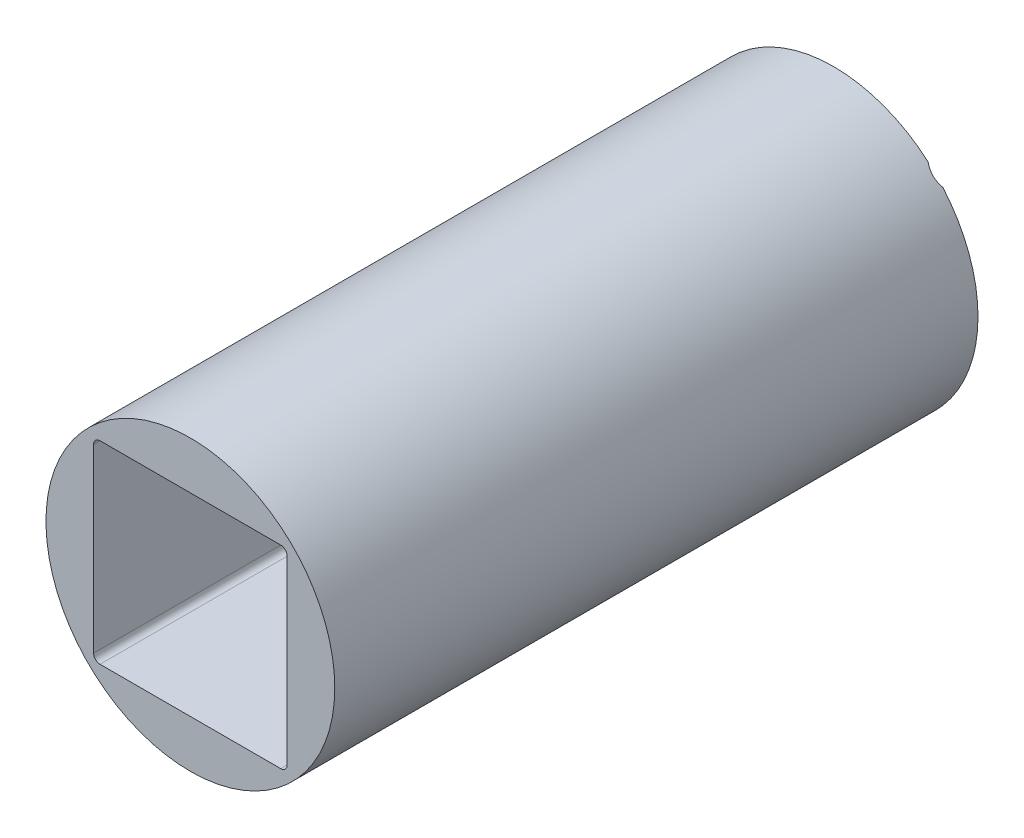
ISO-10303-21;
HEADER;
FILE_DESCRIPTION(('STEP AP214'),'2;1');
FILE_NAME('part.step','',(''),(''),'','','');
FILE_SCHEMA(('AUTOMOTIVE_DESIGN { 1 0 10303 214 1 1 1 1 }'));
ENDSEC;
DATA;
#1=APPLICATION_CONTEXT('core data for automotive mechanical design processes');
#2=APPLICATION_PROTOCOL_DEFINITION('international standard','automotive_design',2000,#1);
#3=PRODUCT_CONTEXT('',#1,'mechanical');
#4=PRODUCT('Part','Part','',(#3));
#5=PRODUCT_RELATED_PRODUCT_CATEGORY('part','',(#4));
#6=PRODUCT_DEFINITION_FORMATION('','',#4);
#7=PRODUCT_DEFINITION_CONTEXT('part definition',#1,'design');
#8=PRODUCT_DEFINITION('design','',#6,#7);
#9=PRODUCT_DEFINITION_SHAPE('','',#8);
#10=(LENGTH_UNIT() NAMED_UNIT(*) SI_UNIT(.MILLI.,.METRE.));
#11=(NAMED_UNIT(*) PLANE_ANGLE_UNIT() SI_UNIT($,.RADIAN.));
#12=(NAMED_UNIT(*) SI_UNIT($,.STERADIAN.) SOLID_ANGLE_UNIT());
#13=UNCERTAINTY_MEASURE_WITH_UNIT(LENGTH_MEASURE(1.E-05),#10,'distance_accuracy_value','');
#14=(GEOMETRIC_REPRESENTATION_CONTEXT(3) GLOBAL_UNCERTAINTY_ASSIGNED_CONTEXT((#13)) GLOBAL_UNIT_ASSIGNED_CONTEXT((#10,
#11,#12)) REPRESENTATION_CONTEXT('',''));
#15=CARTESIAN_POINT('',(0.,0.,0.));
#16=DIRECTION('',(0.,0.,1.));
#17=DIRECTION('',(1.,0.,0.));
#18=AXIS2_PLACEMENT_3D('',#15,#16,#17);
#19=CARTESIAN_POINT('',(0.,0.,0.));
#20=DIRECTION('',(0.,0.,1.));
#21=DIRECTION('',(1.,0.,0.));
#22=AXIS2_PLACEMENT_3D('',#19,#20,#21);
#23=PLANE('',#22);
#24=DIRECTION('',(1.,0.,0.));
#25=VECTOR('',#24,1.);
#26=CARTESIAN_POINT('',(14.05,-17.05,0.));
#27=LINE('',#26,#25);
#28=CARTESIAN_POINT('',(-14.05,-17.05,0.));
#29=VERTEX_POINT('',#28);
#30=CARTESIAN_POINT('',(14.05,-17.05,0.));
#31=VERTEX_POINT('',#30);
#32=EDGE_CURVE('E199',#29,#31,#27,.T.);
#33=ORIENTED_EDGE('',*,*,#32,.T.);
#34=CARTESIAN_POINT('',(14.05,-14.05,0.));
#35=DIRECTION('',(0.,0.,1.));
#36=DIRECTION('',(1.,0.,0.));
#37=AXIS2_PLACEMENT_3D('',#34,#35,#36);
#38=CIRCLE('',#37,3.);
#39=CARTESIAN_POINT('',(14.6833687751314,-16.9823785558295,0.));
#40=VERTEX_POINT('',#39);
#41=EDGE_CURVE('E202',#31,#40,#38,.T.);
#42=ORIENTED_EDGE('',*,*,#41,.T.);
#43=CARTESIAN_POINT('',(0.,0.,0.));
#44=DIRECTION('',(0.,0.,1.));
#45=DIRECTION('',(1.,0.,0.));
#46=AXIS2_PLACEMENT_3D('',#43,#44,#45);
#47=CIRCLE('',#46,22.45);
#48=CARTESIAN_POINT('',(-14.6833687751314,-16.9823785558295,0.));
#49=VERTEX_POINT('',#48);
#50=EDGE_CURVE('E314',#49,#40,#47,.T.);
#51=ORIENTED_EDGE('',*,*,#50,.F.);
#52=CARTESIAN_POINT('',(-14.05,-14.05,0.));
#53=DIRECTION('',(0.,0.,1.));
#54=DIRECTION('',(1.,0.,0.));
#55=AXIS2_PLACEMENT_3D('',#52,#53,#54);
#56=CIRCLE('',#55,3.);
#57=EDGE_CURVE('E197',#49,#29,#56,.T.);
#58=ORIENTED_EDGE('',*,*,#57,.T.);
#59=EDGE_LOOP('',(#33,#42,#51,#58));
#60=FACE_BOUND('',#59,.T.);
#61=ADVANCED_FACE('F35',(#60),#23,.F.);
#62=CARTESIAN_POINT('',(16.9823785558295,-14.6833687751314,0.));
#63=VERTEX_POINT('',#62);
#64=CARTESIAN_POINT('',(16.9823785558295,14.6833687751314,0.));
#65=VERTEX_POINT('',#64);
#66=EDGE_CURVE('E318',#63,#65,#47,.T.);
#67=ORIENTED_EDGE('',*,*,#66,.F.);
#68=CARTESIAN_POINT('',(14.05,-14.05,0.));
#69=DIRECTION('',(0.,0.,1.));
#70=DIRECTION('',(1.,0.,0.));
#71=AXIS2_PLACEMENT_3D('',#68,#69,#70);
#72=CIRCLE('',#71,3.);
#73=CARTESIAN_POINT('',(17.05,-14.05,0.));
#74=VERTEX_POINT('',#73);
#75=EDGE_CURVE('E195',#63,#74,#72,.T.);
#76=ORIENTED_EDGE('',*,*,#75,.T.);
#77=DIRECTION('',(0.,1.,0.));
#78=VECTOR('',#77,1.);
#79=CARTESIAN_POINT('',(17.05,14.05,0.));
#80=LINE('',#79,#78);
#81=CARTESIAN_POINT('',(17.05,14.05,0.));
#82=VERTEX_POINT('',#81);
#83=EDGE_CURVE('E193',#74,#82,#80,.T.);
#84=ORIENTED_EDGE('',*,*,#83,.T.);
#85=CARTESIAN_POINT('',(14.05,14.05,0.));
#86=DIRECTION('',(0.,0.,1.));
#87=DIRECTION('',(1.,0.,0.));
#88=AXIS2_PLACEMENT_3D('',#85,#86,#87);
#89=CIRCLE('',#88,3.);
#90=EDGE_CURVE('E191',#82,#65,#89,.T.);
#91=ORIENTED_EDGE('',*,*,#90,.T.);
#92=EDGE_LOOP('',(#67,#76,#84,#91));
#93=FACE_BOUND('',#92,.T.);
#94=ADVANCED_FACE('F276',(#93),#23,.F.);
#95=DIRECTION('',(0.,-1.,0.));
#96=VECTOR('',#95,1.);
#97=CARTESIAN_POINT('',(-17.05,-14.05,0.));
#98=LINE('',#97,#96);
#99=CARTESIAN_POINT('',(-17.05,14.05,0.));
#100=VERTEX_POINT('',#99);
#101=CARTESIAN_POINT('',(-17.05,-14.05,0.));
#102=VERTEX_POINT('',#101);
#103=EDGE_CURVE('E187',#100,#102,#98,.T.);
#104=ORIENTED_EDGE('',*,*,#103,.T.);
#105=CARTESIAN_POINT('',(-14.05,-14.05,0.));
#106=DIRECTION('',(0.,0.,1.));
#107=DIRECTION('',(1.,0.,0.));
#108=AXIS2_PLACEMENT_3D('',#105,#106,#107);
#109=CIRCLE('',#108,3.);
#110=CARTESIAN_POINT('',(-16.9823785558295,-14.6833687751314,0.));
#111=VERTEX_POINT('',#110);
#112=EDGE_CURVE('E189',#102,#111,#109,.T.);
#113=ORIENTED_EDGE('',*,*,#112,.T.);
#114=CARTESIAN_POINT('',(-16.9823785558295,14.6833687751314,0.));
#115=VERTEX_POINT('',#114);
#116=EDGE_CURVE('E316',#115,#111,#47,.T.);
#117=ORIENTED_EDGE('',*,*,#116,.F.);
#118=CARTESIAN_POINT('',(-14.05,14.05,0.));
#119=DIRECTION('',(0.,0.,1.));
#120=DIRECTION('',(1.,0.,0.));
#121=AXIS2_PLACEMENT_3D('',#118,#119,#120);
#122=CIRCLE('',#121,3.);
#123=EDGE_CURVE('E185',#115,#100,#122,.T.);
#124=ORIENTED_EDGE('',*,*,#123,.T.);
#125=EDGE_LOOP('',(#104,#113,#117,#124));
#126=FACE_BOUND('',#125,.T.);
#127=ADVANCED_FACE('F281',(#126),#23,.F.);
#128=CARTESIAN_POINT('',(0.,0.,100.));
#129=DIRECTION('',(0.,0.,1.));
#130=DIRECTION('',(1.,0.,0.));
#131=AXIS2_PLACEMENT_3D('',#128,#129,#130);
#132=PLANE('',#131);
#133=CARTESIAN_POINT('',(0.,0.,100.));
#134=DIRECTION('',(0.,0.,1.));
#135=DIRECTION('',(1.,0.,0.));
#136=AXIS2_PLACEMENT_3D('',#133,#134,#135);
#137=CIRCLE('',#136,22.45);
#138=CARTESIAN_POINT('',(22.45,0.,100.));
#139=VERTEX_POINT('',#138);
#140=EDGE_CURVE('E158',#139,#139,#137,.T.);
#141=ORIENTED_EDGE('',*,*,#140,.T.);
#142=EDGE_LOOP('',(#141));
#143=FACE_BOUND('',#142,.T.);
#144=DIRECTION('',(-1.,0.,0.));
#145=VECTOR('',#144,1.);
#146=CARTESIAN_POINT('',(-15.05,15.05,100.));
#147=LINE('',#146,#145);
#148=CARTESIAN_POINT('',(14.05,15.05,100.));
#149=VERTEX_POINT('',#148);
#150=CARTESIAN_POINT('',(-14.05,15.05,100.));
#151=VERTEX_POINT('',#150);
#152=EDGE_CURVE('E169',#149,#151,#147,.T.);
#153=ORIENTED_EDGE('',*,*,#152,.F.);
#154=CARTESIAN_POINT('',(14.05,14.05,100.));
#155=DIRECTION('',(0.,0.,1.));
#156=DIRECTION('',(1.,0.,0.));
#157=AXIS2_PLACEMENT_3D('',#154,#155,#156);
#158=CIRCLE('',#157,1.);
#159=CARTESIAN_POINT('',(15.05,14.05,100.));
#160=VERTEX_POINT('',#159);
#161=EDGE_CURVE('E174',#149,#160,#158,.F.);
#162=ORIENTED_EDGE('',*,*,#161,.T.);
#163=DIRECTION('',(0.,1.,0.));
#164=VECTOR('',#163,1.);
#165=CARTESIAN_POINT('',(15.05,15.05,100.));
#166=LINE('',#165,#164);
#167=CARTESIAN_POINT('',(15.05,-14.05,100.));
#168=VERTEX_POINT('',#167);
#169=EDGE_CURVE('E343',#168,#160,#166,.T.);
#170=ORIENTED_EDGE('',*,*,#169,.F.);
#171=CARTESIAN_POINT('',(14.05,-14.05,100.));
#172=DIRECTION('',(0.,0.,1.));
#173=DIRECTION('',(1.,0.,0.));
#174=AXIS2_PLACEMENT_3D('',#171,#172,#173);
#175=CIRCLE('',#174,1.);
#176=CARTESIAN_POINT('',(14.05,-15.05,100.));
#177=VERTEX_POINT('',#176);
#178=EDGE_CURVE('E178',#168,#177,#175,.F.);
#179=ORIENTED_EDGE('',*,*,#178,.T.);
#180=DIRECTION('',(1.,0.,0.));
#181=VECTOR('',#180,1.);
#182=CARTESIAN_POINT('',(-15.05,-15.05,100.));
#183=LINE('',#182,#181);
#184=CARTESIAN_POINT('',(-14.05,-15.05,100.));
#185=VERTEX_POINT('',#184);
#186=EDGE_CURVE('E168',#185,#177,#183,.T.);
#187=ORIENTED_EDGE('',*,*,#186,.F.);
#188=CARTESIAN_POINT('',(-14.05,-14.05,100.));
#189=DIRECTION('',(0.,0.,1.));
#190=DIRECTION('',(1.,0.,0.));
#191=AXIS2_PLACEMENT_3D('',#188,#189,#190);
#192=CIRCLE('',#191,1.);
#193=CARTESIAN_POINT('',(-15.05,-14.05,100.));
#194=VERTEX_POINT('',#193);
#195=EDGE_CURVE('E167',#185,#194,#192,.F.);
#196=ORIENTED_EDGE('',*,*,#195,.T.);
#197=DIRECTION('',(0.,-1.,0.));
#198=VECTOR('',#197,1.);
#199=CARTESIAN_POINT('',(-15.05,15.05,100.));
#200=LINE('',#199,#198);
#201=CARTESIAN_POINT('',(-15.05,14.05,100.));
#202=VERTEX_POINT('',#201);
#203=EDGE_CURVE('E152',#202,#194,#200,.T.);
#204=ORIENTED_EDGE('',*,*,#203,.F.);
#205=CARTESIAN_POINT('',(-14.05,14.05,100.));
#206=DIRECTION('',(0.,0.,1.));
#207=DIRECTION('',(1.,0.,0.));
#208=AXIS2_PLACEMENT_3D('',#205,#206,#207);
#209=CIRCLE('',#208,1.);
#210=EDGE_CURVE('E163',#202,#151,#209,.F.);
#211=ORIENTED_EDGE('',*,*,#210,.T.);
#212=EDGE_LOOP('',(#153,#162,#170,#179,#187,#196,#204,#211));
#213=FACE_BOUND('',#212,.T.);
#214=ADVANCED_FACE('F162',(#143,#213),#132,.T.);
#215=CARTESIAN_POINT('',(14.6833687751314,16.9823785558295,0.));
#216=VERTEX_POINT('',#215);
#217=CARTESIAN_POINT('',(-14.6833687751314,16.9823785558295,0.));
#218=VERTEX_POINT('',#217);
#219=EDGE_CURVE('E320',#216,#218,#47,.T.);
#220=ORIENTED_EDGE('',*,*,#219,.F.);
#221=CARTESIAN_POINT('',(14.05,14.05,0.));
#222=DIRECTION('',(0.,0.,1.));
#223=DIRECTION('',(1.,0.,0.));
#224=AXIS2_PLACEMENT_3D('',#221,#222,#223);
#225=CIRCLE('',#224,3.);
#226=CARTESIAN_POINT('',(14.05,17.05,0.));
#227=VERTEX_POINT('',#226);
#228=EDGE_CURVE('E183',#216,#227,#225,.T.);
#229=ORIENTED_EDGE('',*,*,#228,.T.);
#230=DIRECTION('',(-1.,0.,0.));
#231=VECTOR('',#230,1.);
#232=CARTESIAN_POINT('',(-14.05,17.05,0.));
#233=LINE('',#232,#231);
#234=CARTESIAN_POINT('',(-14.05,17.05,0.));
#235=VERTEX_POINT('',#234);
#236=EDGE_CURVE('E173',#227,#235,#233,.T.);
#237=ORIENTED_EDGE('',*,*,#236,.T.);
#238=CARTESIAN_POINT('',(-14.05,14.05,0.));
#239=DIRECTION('',(0.,0.,1.));
#240=DIRECTION('',(1.,0.,0.));
#241=AXIS2_PLACEMENT_3D('',#238,#239,#240);
#242=CIRCLE('',#241,3.);
#243=EDGE_CURVE('E176',#235,#218,#242,.T.);
#244=ORIENTED_EDGE('',*,*,#243,.T.);
#245=EDGE_LOOP('',(#220,#229,#237,#244));
#246=FACE_BOUND('',#245,.T.);
#247=ADVANCED_FACE('F229',(#246),#23,.F.);
#248=CARTESIAN_POINT('',(0.,0.,100.));
#249=DIRECTION('',(0.,0.,-1.));
#250=DIRECTION('',(-1.,0.,0.));
#251=AXIS2_PLACEMENT_3D('',#248,#249,#250);
#252=CYLINDRICAL_SURFACE('',#251,22.45);
#253=ORIENTED_EDGE('',*,*,#140,.F.);
#254=EDGE_LOOP('',(#253));
#255=FACE_BOUND('',#254,.T.);
#256=ORIENTED_EDGE('',*,*,#50,.T.);
#257=CARTESIAN_POINT('',(14.6833687751314,-16.9823785558295,0.));
#258=CARTESIAN_POINT('',(14.7571049820052,-16.9186227533409,0.0467171487312481));
#259=CARTESIAN_POINT('',(14.8313929170466,-16.8535539087366,0.0910111100037045));
#260=CARTESIAN_POINT('',(14.9813047209221,-16.7204398931368,0.173316229968785));
#261=CARTESIAN_POINT('',(15.0569323818324,-16.6523850205554,0.211304642780494));
#262=CARTESIAN_POINT('',(15.2086910136612,-16.5138936549978,0.278967279085999));
#263=CARTESIAN_POINT('',(15.2848145351285,-16.4434776369421,0.308698930974258));
#264=CARTESIAN_POINT('',(15.4376706129103,-16.3000546463504,0.358401262974627));
#265=CARTESIAN_POINT('',(15.5144021811468,-16.2270513924072,0.378385387793398));
#266=CARTESIAN_POINT('',(15.6533374220134,-16.0929488445354,0.404428679902609));
#267=CARTESIAN_POINT('',(15.7155361337055,-16.0322180742832,0.412410101737596));
#268=CARTESIAN_POINT('',(15.8394946195988,-15.9097611091886,0.420575135971272));
#269=CARTESIAN_POINT('',(15.9012543306015,-15.8480347750446,0.42075764749195));
#270=CARTESIAN_POINT('',(16.0238386297447,-15.7240801283621,0.413304097345723));
#271=CARTESIAN_POINT('',(16.0846628070022,-15.6618516125855,0.405664694543));
#272=CARTESIAN_POINT('',(16.2048979871649,-15.537415425585,0.383013417214548));
#273=CARTESIAN_POINT('',(16.2643090470785,-15.4752077536203,0.368001840629487));
#274=CARTESIAN_POINT('',(16.4399326164447,-15.2892162112106,0.313039066068512));
#275=CARTESIAN_POINT('',(16.5536467303387,-15.165951138247,0.263150740275131));
#276=CARTESIAN_POINT('',(16.7185271776328,-14.9833284331374,0.174007397988478));
#277=CARTESIAN_POINT('',(16.7725656633399,-14.9228022669733,0.141887244224032));
#278=CARTESIAN_POINT('',(16.8787944602109,-14.8025398164352,0.0737082125462459));
#279=CARTESIAN_POINT('',(16.9309875452848,-14.7428024391815,0.0376556107821658));
#280=CARTESIAN_POINT('',(16.9823785558295,-14.6833687751314,0.));
#281=B_SPLINE_CURVE_WITH_KNOTS('',3,(#257,#258,#259,#260,#261,#262,#263,#264,#265,#266,#267,
#268,#269,#270,#271,#272,#273,#274,#275,#276,#277,#278,#279,#280),.UNSPECIFIED.,.F.,.F.,(4,2,2,
2,2,2,2,2,2,2,2,4),(0.,0.32440313820883,0.649952188997923,0.97317674764834,1.29595421493081,
1.55750890667116,1.81910051880759,2.08080391660687,2.34249673873715,2.86541230931677,
3.12714421092917,3.38846433956202),.UNSPECIFIED.);
#282=EDGE_CURVE('E244',#40,#63,#281,.T.);
#283=ORIENTED_EDGE('',*,*,#282,.T.);
#284=ORIENTED_EDGE('',*,*,#66,.T.);
#285=CARTESIAN_POINT('',(16.9823785558295,14.6833687751314,0.));
#286=CARTESIAN_POINT('',(16.9186227533409,14.7571049820052,0.0467171487312481));
#287=CARTESIAN_POINT('',(16.8535539087366,14.8313929170466,0.0910111100037045));
#288=CARTESIAN_POINT('',(16.7204398931368,14.9813047209221,0.173316229968785));
#289=CARTESIAN_POINT('',(16.6523850205554,15.0569323818324,0.211304642780494));
#290=CARTESIAN_POINT('',(16.5138936549978,15.2086910136612,0.278967279085999));
#291=CARTESIAN_POINT('',(16.4434776369421,15.2848145351285,0.308698930974258));
#292=CARTESIAN_POINT('',(16.3000546463504,15.4376706129103,0.358401262974627));
#293=CARTESIAN_POINT('',(16.2270513924072,15.5144021811468,0.378385387793398));
#294=CARTESIAN_POINT('',(16.0929488445354,15.6533374220134,0.404428679902609));
#295=CARTESIAN_POINT('',(16.0322180742832,15.7155361337055,0.412410101737596));
#296=CARTESIAN_POINT('',(15.9097611091886,15.8394946195988,0.420575135971272));
#297=CARTESIAN_POINT('',(15.8480347750446,15.9012543306015,0.42075764749195));
#298=CARTESIAN_POINT('',(15.7240801283621,16.0238386297447,0.413304097345723));
#299=CARTESIAN_POINT('',(15.6618516125855,16.0846628070022,0.405664694543));
#300=CARTESIAN_POINT('',(15.537415425585,16.2048979871649,0.383013417214548));
#301=CARTESIAN_POINT('',(15.4752077536203,16.2643090470785,0.368001840629487));
#302=CARTESIAN_POINT('',(15.2892162112106,16.4399326164447,0.313039066068512));
#303=CARTESIAN_POINT('',(15.165951138247,16.5536467303387,0.263150740275131));
#304=CARTESIAN_POINT('',(14.9833284331374,16.7185271776328,0.174007397988478));
#305=CARTESIAN_POINT('',(14.9228022669733,16.7725656633399,0.141887244224032));
#306=CARTESIAN_POINT('',(14.8025398164352,16.8787944602109,0.0737082125462459));
#307=CARTESIAN_POINT('',(14.7428024391815,16.9309875452848,0.0376556107821658));
#308=CARTESIAN_POINT('',(14.6833687751314,16.9823785558295,0.));
#309=B_SPLINE_CURVE_WITH_KNOTS('',3,(#285,#286,#287,#288,#289,#290,#291,#292,#293,#294,#295,
#296,#297,#298,#299,#300,#301,#302,#303,#304,#305,#306,#307,#308),.UNSPECIFIED.,.F.,.F.,(4,2,2,
2,2,2,2,2,2,2,2,4),(0.,0.32440313820883,0.649952188997923,0.97317674764834,1.29595421493081,
1.55750890667116,1.81910051880759,2.08080391660687,2.34249673873715,2.86541230931677,
3.12714421092917,3.38846433956202),.UNSPECIFIED.);
#310=EDGE_CURVE('E214',#65,#216,#309,.T.);
#311=ORIENTED_EDGE('',*,*,#310,.T.);
#312=ORIENTED_EDGE('',*,*,#219,.T.);
#313=CARTESIAN_POINT('',(-14.6833687751314,16.9823785558295,0.));
#314=CARTESIAN_POINT('',(-14.7571049820052,16.9186227533409,0.0467171487312487));
#315=CARTESIAN_POINT('',(-14.8313929170466,16.8535539087366,0.0910111100037054));
#316=CARTESIAN_POINT('',(-14.9813047209221,16.7204398931368,0.173316229968786));
#317=CARTESIAN_POINT('',(-15.0569323818324,16.6523850205554,0.211304642780495));
#318=CARTESIAN_POINT('',(-15.2086910136612,16.5138936549978,0.278967279086));
#319=CARTESIAN_POINT('',(-15.2848145351285,16.4434776369421,0.308698930974259));
#320=CARTESIAN_POINT('',(-15.4376706129103,16.3000546463504,0.358401262974627));
#321=CARTESIAN_POINT('',(-15.5144021811468,16.2270513924072,0.378385387793396));
#322=CARTESIAN_POINT('',(-15.6533374220134,16.0929488445354,0.404428679902607));
#323=CARTESIAN_POINT('',(-15.7155361337055,16.0322180742832,0.412410101737596));
#324=CARTESIAN_POINT('',(-15.8394946195988,15.9097611091886,0.420575135971273));
#325=CARTESIAN_POINT('',(-15.9012543306015,15.8480347750446,0.420757647491951));
#326=CARTESIAN_POINT('',(-16.0238386297446,15.7240801283621,0.413304097345725));
#327=CARTESIAN_POINT('',(-16.0846628070022,15.6618516125855,0.405664694543003));
#328=CARTESIAN_POINT('',(-16.2048979871649,15.537415425585,0.383013417214549));
#329=CARTESIAN_POINT('',(-16.2643090470785,15.4752077536203,0.368001840629485));
#330=CARTESIAN_POINT('',(-16.4399326164447,15.2892162112107,0.313039066068507));
#331=CARTESIAN_POINT('',(-16.5536467303387,15.165951138247,0.26315074027513));
#332=CARTESIAN_POINT('',(-16.7185271776328,14.9833284331374,0.174007397988479));
#333=CARTESIAN_POINT('',(-16.7725656633399,14.9228022669733,0.141887244224031));
#334=CARTESIAN_POINT('',(-16.8787944602109,14.8025398164352,0.0737082125462445));
#335=CARTESIAN_POINT('',(-16.9309875452848,14.7428024391815,0.0376556107821645));
#336=CARTESIAN_POINT('',(-16.9823785558295,14.6833687751314,0.));
#337=B_SPLINE_CURVE_WITH_KNOTS('',3,(#313,#314,#315,#316,#317,#318,#319,#320,#321,#322,#323,
#324,#325,#326,#327,#328,#329,#330,#331,#332,#333,#334,#335,#336),.UNSPECIFIED.,.F.,.F.,(4,2,2,
2,2,2,2,2,2,2,2,4),(0.,0.324403138208832,0.649952188997923,0.973176747648337,1.2959542149308,
1.55750890667116,1.81910051880759,2.08080391660687,2.34249673873715,2.86541230931677,
3.12714421092917,3.38846433956202),.UNSPECIFIED.);
#338=EDGE_CURVE('E207',#218,#115,#337,.T.);
#339=ORIENTED_EDGE('',*,*,#338,.T.);
#340=ORIENTED_EDGE('',*,*,#116,.T.);
#341=CARTESIAN_POINT('',(-16.9823785558295,-14.6833687751314,0.));
#342=CARTESIAN_POINT('',(-16.9186227533409,-14.7571049820052,0.0467171487312433));
#343=CARTESIAN_POINT('',(-16.8535539087366,-14.8313929170466,0.0910111100036992));
#344=CARTESIAN_POINT('',(-16.7204398931368,-14.9813047209221,0.173316229968781));
#345=CARTESIAN_POINT('',(-16.6523850205554,-15.0569323818324,0.211304642780492));
#346=CARTESIAN_POINT('',(-16.5138936549978,-15.2086910136612,0.278967279085996));
#347=CARTESIAN_POINT('',(-16.4434776369421,-15.2848145351285,0.308698930974253));
#348=CARTESIAN_POINT('',(-16.3000546463504,-15.4376706129103,0.35840126297462));
#349=CARTESIAN_POINT('',(-16.2270513924072,-15.5144021811468,0.378385387793391));
#350=CARTESIAN_POINT('',(-16.0929488445354,-15.6533374220134,0.404428679902602));
#351=CARTESIAN_POINT('',(-16.0322180742832,-15.7155361337055,0.41241010173759));
#352=CARTESIAN_POINT('',(-15.9097611091886,-15.8394946195988,0.420575135971266));
#353=CARTESIAN_POINT('',(-15.8480347750446,-15.9012543306015,0.420757647491945));
#354=CARTESIAN_POINT('',(-15.7240801283621,-16.0238386297447,0.413304097345717));
#355=CARTESIAN_POINT('',(-15.6618516125855,-16.0846628070022,0.405664694542994));
#356=CARTESIAN_POINT('',(-15.537415425585,-16.2048979871649,0.38301341721454));
#357=CARTESIAN_POINT('',(-15.4752077536203,-16.2643090470785,0.368001840629479));
#358=CARTESIAN_POINT('',(-15.2892162112106,-16.4399326164447,0.313039066068503));
#359=CARTESIAN_POINT('',(-15.165951138247,-16.5536467303387,0.263150740275122));
#360=CARTESIAN_POINT('',(-14.9833284331374,-16.7185271776328,0.17400739798847));
#361=CARTESIAN_POINT('',(-14.9228022669733,-16.7725656633399,0.141887244224024));
#362=CARTESIAN_POINT('',(-14.8025398164352,-16.8787944602109,0.0737082125462389));
#363=CARTESIAN_POINT('',(-14.7428024391815,-16.9309875452848,0.0376556107821596));
#364=CARTESIAN_POINT('',(-14.6833687751314,-16.9823785558295,0.));
#365=B_SPLINE_CURVE_WITH_KNOTS('',3,(#341,#342,#343,#344,#345,#346,#347,#348,#349,#350,#351,
#352,#353,#354,#355,#356,#357,#358,#359,#360,#361,#362,#363,#364),.UNSPECIFIED.,.F.,.F.,(4,2,2,
2,2,2,2,2,2,2,2,4),(0.,0.324403138208832,0.649952188997925,0.973176747648339,1.29595421493081,
1.55750890667116,1.81910051880759,2.08080391660687,2.34249673873715,2.86541230931677,
3.12714421092917,3.38846433956202),.UNSPECIFIED.);
#366=EDGE_CURVE('E238',#111,#49,#365,.T.);
#367=ORIENTED_EDGE('',*,*,#366,.T.);
#368=EDGE_LOOP('',(#256,#283,#284,#311,#312,#339,#340,#367));
#369=FACE_BOUND('',#368,.T.);
#370=ADVANCED_FACE('F223',(#255,#369),#252,.T.);
#371=CARTESIAN_POINT('',(15.05,15.05,100.));
#372=DIRECTION('',(-1.,0.,0.));
#373=DIRECTION('',(0.,-1.,0.));
#374=AXIS2_PLACEMENT_3D('',#371,#372,#373);
#375=PLANE('',#374);
#376=DIRECTION('',(0.,0.,-1.));
#377=VECTOR('',#376,1.);
#378=CARTESIAN_POINT('',(15.05,14.05,0.));
#379=LINE('',#378,#377);
#380=CARTESIAN_POINT('',(15.05,14.05,2.));
#381=VERTEX_POINT('',#380);
#382=EDGE_CURVE('E331',#160,#381,#379,.T.);
#383=ORIENTED_EDGE('',*,*,#382,.T.);
#384=DIRECTION('',(0.,-1.,0.));
#385=VECTOR('',#384,1.);
#386=CARTESIAN_POINT('',(15.05,-14.05,2.));
#387=LINE('',#386,#385);
#388=CARTESIAN_POINT('',(15.05,-14.05,2.));
#389=VERTEX_POINT('',#388);
#390=EDGE_CURVE('E359',#381,#389,#387,.T.);
#391=ORIENTED_EDGE('',*,*,#390,.T.);
#392=DIRECTION('',(0.,0.,-1.));
#393=VECTOR('',#392,1.);
#394=CARTESIAN_POINT('',(15.05,-14.05,100.));
#395=LINE('',#394,#393);
#396=EDGE_CURVE('E334',#389,#168,#395,.F.);
#397=ORIENTED_EDGE('',*,*,#396,.T.);
#398=ORIENTED_EDGE('',*,*,#169,.T.);
#399=EDGE_LOOP('',(#383,#391,#397,#398));
#400=FACE_BOUND('',#399,.T.);
#401=ADVANCED_FACE('F228',(#400),#375,.T.);
#402=CARTESIAN_POINT('',(-15.05,15.05,100.));
#403=DIRECTION('',(0.,-1.,0.));
#404=DIRECTION('',(0.,0.,-1.));
#405=AXIS2_PLACEMENT_3D('',#402,#403,#404);
#406=PLANE('',#405);
#407=DIRECTION('',(0.,0.,-1.));
#408=VECTOR('',#407,1.);
#409=CARTESIAN_POINT('',(-14.05,15.05,0.));
#410=LINE('',#409,#408);
#411=CARTESIAN_POINT('',(-14.05,15.05,2.));
#412=VERTEX_POINT('',#411);
#413=EDGE_CURVE('E172',#151,#412,#410,.T.);
#414=ORIENTED_EDGE('',*,*,#413,.T.);
#415=DIRECTION('',(1.,0.,0.));
#416=VECTOR('',#415,1.);
#417=CARTESIAN_POINT('',(14.05,15.05,2.));
#418=LINE('',#417,#416);
#419=CARTESIAN_POINT('',(14.05,15.05,2.));
#420=VERTEX_POINT('',#419);
#421=EDGE_CURVE('E11',#412,#420,#418,.T.);
#422=ORIENTED_EDGE('',*,*,#421,.T.);
#423=DIRECTION('',(0.,0.,-1.));
#424=VECTOR('',#423,1.);
#425=CARTESIAN_POINT('',(14.05,15.05,100.));
#426=LINE('',#425,#424);
#427=EDGE_CURVE('E337',#420,#149,#426,.F.);
#428=ORIENTED_EDGE('',*,*,#427,.T.);
#429=ORIENTED_EDGE('',*,*,#152,.T.);
#430=EDGE_LOOP('',(#414,#422,#428,#429));
#431=FACE_BOUND('',#430,.T.);
#432=ADVANCED_FACE('F387',(#431),#406,.T.);
#433=CARTESIAN_POINT('',(-15.05,15.05,100.));
#434=DIRECTION('',(1.,0.,0.));
#435=DIRECTION('',(0.,1.,0.));
#436=AXIS2_PLACEMENT_3D('',#433,#434,#435);
#437=PLANE('',#436);
#438=DIRECTION('',(0.,0.,-1.));
#439=VECTOR('',#438,1.);
#440=CARTESIAN_POINT('',(-15.05,-14.05,0.));
#441=LINE('',#440,#439);
#442=CARTESIAN_POINT('',(-15.05,-14.05,2.));
#443=VERTEX_POINT('',#442);
#444=EDGE_CURVE('E157',#194,#443,#441,.T.);
#445=ORIENTED_EDGE('',*,*,#444,.T.);
#446=DIRECTION('',(0.,1.,0.));
#447=VECTOR('',#446,1.);
#448=CARTESIAN_POINT('',(-15.05,14.05,2.));
#449=LINE('',#448,#447);
#450=CARTESIAN_POINT('',(-15.05,14.05,2.));
#451=VERTEX_POINT('',#450);
#452=EDGE_CURVE('E155',#443,#451,#449,.T.);
#453=ORIENTED_EDGE('',*,*,#452,.T.);
#454=DIRECTION('',(0.,0.,-1.));
#455=VECTOR('',#454,1.);
#456=CARTESIAN_POINT('',(-15.05,14.05,100.));
#457=LINE('',#456,#455);
#458=EDGE_CURVE('E148',#451,#202,#457,.F.);
#459=ORIENTED_EDGE('',*,*,#458,.T.);
#460=ORIENTED_EDGE('',*,*,#203,.T.);
#461=EDGE_LOOP('',(#445,#453,#459,#460));
#462=FACE_BOUND('',#461,.T.);
#463=ADVANCED_FACE('F151',(#462),#437,.T.);
#464=CARTESIAN_POINT('',(-15.05,-15.05,100.));
#465=DIRECTION('',(0.,1.,0.));
#466=DIRECTION('',(0.,0.,1.));
#467=AXIS2_PLACEMENT_3D('',#464,#465,#466);
#468=PLANE('',#467);
#469=DIRECTION('',(0.,0.,-1.));
#470=VECTOR('',#469,1.);
#471=CARTESIAN_POINT('',(14.05,-15.05,0.));
#472=LINE('',#471,#470);
#473=CARTESIAN_POINT('',(14.05,-15.05,2.));
#474=VERTEX_POINT('',#473);
#475=EDGE_CURVE('E326',#177,#474,#472,.T.);
#476=ORIENTED_EDGE('',*,*,#475,.T.);
#477=DIRECTION('',(-1.,0.,0.));
#478=VECTOR('',#477,1.);
#479=CARTESIAN_POINT('',(-14.05,-15.05,2.));
#480=LINE('',#479,#478);
#481=CARTESIAN_POINT('',(-14.05,-15.05,2.));
#482=VERTEX_POINT('',#481);
#483=EDGE_CURVE('E204',#474,#482,#480,.T.);
#484=ORIENTED_EDGE('',*,*,#483,.T.);
#485=DIRECTION('',(0.,0.,-1.));
#486=VECTOR('',#485,1.);
#487=CARTESIAN_POINT('',(-14.05,-15.05,100.));
#488=LINE('',#487,#486);
#489=EDGE_CURVE('E329',#482,#185,#488,.F.);
#490=ORIENTED_EDGE('',*,*,#489,.T.);
#491=ORIENTED_EDGE('',*,*,#186,.T.);
#492=EDGE_LOOP('',(#476,#484,#490,#491));
#493=FACE_BOUND('',#492,.T.);
#494=ADVANCED_FACE('F348',(#493),#468,.T.);
#495=CARTESIAN_POINT('',(-14.05,-14.05,100.));
#496=DIRECTION('',(0.,0.,1.));
#497=DIRECTION('',(1.,0.,0.));
#498=AXIS2_PLACEMENT_3D('',#495,#496,#497);
#499=CYLINDRICAL_SURFACE('',#498,1.);
#500=ORIENTED_EDGE('',*,*,#489,.F.);
#501=CARTESIAN_POINT('',(-14.05,-14.05,2.));
#502=DIRECTION('',(0.,0.,1.));
#503=DIRECTION('',(1.,0.,0.));
#504=AXIS2_PLACEMENT_3D('',#501,#502,#503);
#505=CIRCLE('',#504,1.);
#506=EDGE_CURVE('E358',#482,#443,#505,.F.);
#507=ORIENTED_EDGE('',*,*,#506,.T.);
#508=ORIENTED_EDGE('',*,*,#444,.F.);
#509=ORIENTED_EDGE('',*,*,#195,.F.);
#510=EDGE_LOOP('',(#500,#507,#508,#509));
#511=FACE_BOUND('',#510,.T.);
#512=ADVANCED_FACE('F232',(#511),#499,.F.);
#513=CARTESIAN_POINT('',(14.05,-14.05,100.));
#514=DIRECTION('',(0.,0.,1.));
#515=DIRECTION('',(1.,0.,0.));
#516=AXIS2_PLACEMENT_3D('',#513,#514,#515);
#517=CYLINDRICAL_SURFACE('',#516,1.);
#518=ORIENTED_EDGE('',*,*,#396,.F.);
#519=CARTESIAN_POINT('',(14.05,-14.05,2.));
#520=DIRECTION('',(0.,0.,1.));
#521=DIRECTION('',(1.,0.,0.));
#522=AXIS2_PLACEMENT_3D('',#519,#520,#521);
#523=CIRCLE('',#522,1.);
#524=EDGE_CURVE('E353',#389,#474,#523,.F.);
#525=ORIENTED_EDGE('',*,*,#524,.T.);
#526=ORIENTED_EDGE('',*,*,#475,.F.);
#527=ORIENTED_EDGE('',*,*,#178,.F.);
#528=EDGE_LOOP('',(#518,#525,#526,#527));
#529=FACE_BOUND('',#528,.T.);
#530=ADVANCED_FACE('F351',(#529),#517,.F.);
#531=CARTESIAN_POINT('',(14.05,14.05,100.));
#532=DIRECTION('',(0.,0.,1.));
#533=DIRECTION('',(1.,0.,0.));
#534=AXIS2_PLACEMENT_3D('',#531,#532,#533);
#535=CYLINDRICAL_SURFACE('',#534,1.);
#536=ORIENTED_EDGE('',*,*,#427,.F.);
#537=CARTESIAN_POINT('',(14.05,14.05,2.));
#538=DIRECTION('',(0.,0.,1.));
#539=DIRECTION('',(1.,0.,0.));
#540=AXIS2_PLACEMENT_3D('',#537,#538,#539);
#541=CIRCLE('',#540,1.);
#542=EDGE_CURVE('E364',#420,#381,#541,.F.);
#543=ORIENTED_EDGE('',*,*,#542,.T.);
#544=ORIENTED_EDGE('',*,*,#382,.F.);
#545=ORIENTED_EDGE('',*,*,#161,.F.);
#546=EDGE_LOOP('',(#536,#543,#544,#545));
#547=FACE_BOUND('',#546,.T.);
#548=ADVANCED_FACE('F390',(#547),#535,.F.);
#549=CARTESIAN_POINT('',(-14.05,14.05,100.));
#550=DIRECTION('',(0.,0.,1.));
#551=DIRECTION('',(1.,0.,0.));
#552=AXIS2_PLACEMENT_3D('',#549,#550,#551);
#553=CYLINDRICAL_SURFACE('',#552,1.);
#554=ORIENTED_EDGE('',*,*,#458,.F.);
#555=CARTESIAN_POINT('',(-14.05,14.05,2.));
#556=DIRECTION('',(0.,0.,1.));
#557=DIRECTION('',(1.,0.,0.));
#558=AXIS2_PLACEMENT_3D('',#555,#556,#557);
#559=CIRCLE('',#558,1.);
#560=EDGE_CURVE('E44',#451,#412,#559,.F.);
#561=ORIENTED_EDGE('',*,*,#560,.T.);
#562=ORIENTED_EDGE('',*,*,#413,.F.);
#563=ORIENTED_EDGE('',*,*,#210,.F.);
#564=EDGE_LOOP('',(#554,#561,#562,#563));
#565=FACE_BOUND('',#564,.T.);
#566=ADVANCED_FACE('F171',(#565),#553,.F.);
#567=CARTESIAN_POINT('',(0.,17.05,0.));
#568=DIRECTION('',(0.,-0.707106781186548,-0.707106781186547));
#569=DIRECTION('',(1.,0.,0.));
#570=AXIS2_PLACEMENT_3D('',#567,#568,#569);
#571=PLANE('',#570);
#572=DIRECTION('',(0.,0.707106781186547,-0.707106781186548));
#573=VECTOR('',#572,1.);
#574=CARTESIAN_POINT('',(14.05,15.05,2.));
#575=LINE('',#574,#573);
#576=EDGE_CURVE('E375',#420,#227,#575,.T.);
#577=ORIENTED_EDGE('',*,*,#576,.F.);
#578=ORIENTED_EDGE('',*,*,#421,.F.);
#579=DIRECTION('',(0.,-0.707106781186547,0.707106781186548));
#580=VECTOR('',#579,1.);
#581=CARTESIAN_POINT('',(-14.05,17.05,0.));
#582=LINE('',#581,#580);
#583=EDGE_CURVE('E39',#235,#412,#582,.T.);
#584=ORIENTED_EDGE('',*,*,#583,.F.);
#585=ORIENTED_EDGE('',*,*,#236,.F.);
#586=EDGE_LOOP('',(#577,#578,#584,#585));
#587=FACE_BOUND('',#586,.T.);
#588=ADVANCED_FACE('F37',(#587),#571,.T.);
#589=CARTESIAN_POINT('',(-14.05,14.05,0.));
#590=DIRECTION('',(0.,0.,-1.));
#591=DIRECTION('',(-1.,0.,0.));
#592=AXIS2_PLACEMENT_3D('',#589,#590,#591);
#593=CONICAL_SURFACE('',#592,3.,0.785398163397449);
#594=ORIENTED_EDGE('',*,*,#583,.T.);
#595=ORIENTED_EDGE('',*,*,#560,.F.);
#596=DIRECTION('',(0.707106781186547,0.,0.707106781186547));
#597=VECTOR('',#596,1.);
#598=CARTESIAN_POINT('',(-17.05,14.05,0.));
#599=LINE('',#598,#597);
#600=EDGE_CURVE('E374',#100,#451,#599,.T.);
#601=ORIENTED_EDGE('',*,*,#600,.F.);
#602=ORIENTED_EDGE('',*,*,#123,.F.);
#603=ORIENTED_EDGE('',*,*,#338,.F.);
#604=ORIENTED_EDGE('',*,*,#243,.F.);
#605=EDGE_LOOP('',(#594,#595,#601,#602,#603,#604));
#606=FACE_BOUND('',#605,.T.);
#607=ADVANCED_FACE('F221',(#606),#593,.F.);
#608=CARTESIAN_POINT('',(14.05,14.05,0.));
#609=DIRECTION('',(0.,0.,-1.));
#610=DIRECTION('',(-1.,0.,0.));
#611=AXIS2_PLACEMENT_3D('',#608,#609,#610);
#612=CONICAL_SURFACE('',#611,3.,0.785398163397449);
#613=ORIENTED_EDGE('',*,*,#310,.F.);
#614=ORIENTED_EDGE('',*,*,#90,.F.);
#615=DIRECTION('',(0.707106781186547,0.,-0.707106781186547));
#616=VECTOR('',#615,1.);
#617=CARTESIAN_POINT('',(15.05,14.05,2.));
#618=LINE('',#617,#616);
#619=EDGE_CURVE('E305',#381,#82,#618,.T.);
#620=ORIENTED_EDGE('',*,*,#619,.F.);
#621=ORIENTED_EDGE('',*,*,#542,.F.);
#622=ORIENTED_EDGE('',*,*,#576,.T.);
#623=ORIENTED_EDGE('',*,*,#228,.F.);
#624=EDGE_LOOP('',(#613,#614,#620,#621,#622,#623));
#625=FACE_BOUND('',#624,.T.);
#626=ADVANCED_FACE('F265',(#625),#612,.F.);
#627=CARTESIAN_POINT('',(-17.05,0.,0.));
#628=DIRECTION('',(0.707106781186548,0.,-0.707106781186547));
#629=DIRECTION('',(0.,1.,0.));
#630=AXIS2_PLACEMENT_3D('',#627,#628,#629);
#631=PLANE('',#630);
#632=ORIENTED_EDGE('',*,*,#600,.T.);
#633=ORIENTED_EDGE('',*,*,#452,.F.);
#634=DIRECTION('',(0.707106781186547,0.,0.707106781186547));
#635=VECTOR('',#634,1.);
#636=CARTESIAN_POINT('',(-17.05,-14.05,0.));
#637=LINE('',#636,#635);
#638=EDGE_CURVE('E303',#102,#443,#637,.T.);
#639=ORIENTED_EDGE('',*,*,#638,.F.);
#640=ORIENTED_EDGE('',*,*,#103,.F.);
#641=EDGE_LOOP('',(#632,#633,#639,#640));
#642=FACE_BOUND('',#641,.T.);
#643=ADVANCED_FACE('F262',(#642),#631,.T.);
#644=CARTESIAN_POINT('',(17.05,0.,0.));
#645=DIRECTION('',(-0.707106781186547,0.,-0.707106781186548));
#646=DIRECTION('',(0.,-1.,0.));
#647=AXIS2_PLACEMENT_3D('',#644,#645,#646);
#648=PLANE('',#647);
#649=ORIENTED_EDGE('',*,*,#619,.T.);
#650=ORIENTED_EDGE('',*,*,#83,.F.);
#651=DIRECTION('',(0.707106781186548,0.,-0.707106781186547));
#652=VECTOR('',#651,1.);
#653=CARTESIAN_POINT('',(15.05,-14.05,2.));
#654=LINE('',#653,#652);
#655=EDGE_CURVE('E306',#389,#74,#654,.T.);
#656=ORIENTED_EDGE('',*,*,#655,.F.);
#657=ORIENTED_EDGE('',*,*,#390,.F.);
#658=EDGE_LOOP('',(#649,#650,#656,#657));
#659=FACE_BOUND('',#658,.T.);
#660=ADVANCED_FACE('F256',(#659),#648,.T.);
#661=CARTESIAN_POINT('',(-14.05,-14.05,0.));
#662=DIRECTION('',(0.,0.,-1.));
#663=DIRECTION('',(-1.,0.,0.));
#664=AXIS2_PLACEMENT_3D('',#661,#662,#663);
#665=CONICAL_SURFACE('',#664,3.,0.785398163397449);
#666=ORIENTED_EDGE('',*,*,#638,.T.);
#667=ORIENTED_EDGE('',*,*,#506,.F.);
#668=DIRECTION('',(0.,0.707106781186548,0.707106781186547));
#669=VECTOR('',#668,1.);
#670=CARTESIAN_POINT('',(-14.05,-17.05,0.));
#671=LINE('',#670,#669);
#672=EDGE_CURVE('E369',#29,#482,#671,.T.);
#673=ORIENTED_EDGE('',*,*,#672,.F.);
#674=ORIENTED_EDGE('',*,*,#57,.F.);
#675=ORIENTED_EDGE('',*,*,#366,.F.);
#676=ORIENTED_EDGE('',*,*,#112,.F.);
#677=EDGE_LOOP('',(#666,#667,#673,#674,#675,#676));
#678=FACE_BOUND('',#677,.T.);
#679=ADVANCED_FACE('F251',(#678),#665,.F.);
#680=CARTESIAN_POINT('',(14.05,-14.05,0.));
#681=DIRECTION('',(0.,0.,-1.));
#682=DIRECTION('',(-1.,0.,0.));
#683=AXIS2_PLACEMENT_3D('',#680,#681,#682);
#684=CONICAL_SURFACE('',#683,3.,0.785398163397449);
#685=ORIENTED_EDGE('',*,*,#282,.F.);
#686=ORIENTED_EDGE('',*,*,#41,.F.);
#687=DIRECTION('',(0.,-0.707106781186548,-0.707106781186547));
#688=VECTOR('',#687,1.);
#689=CARTESIAN_POINT('',(14.05,-15.05,2.));
#690=LINE('',#689,#688);
#691=EDGE_CURVE('E367',#474,#31,#690,.T.);
#692=ORIENTED_EDGE('',*,*,#691,.F.);
#693=ORIENTED_EDGE('',*,*,#524,.F.);
#694=ORIENTED_EDGE('',*,*,#655,.T.);
#695=ORIENTED_EDGE('',*,*,#75,.F.);
#696=EDGE_LOOP('',(#685,#686,#692,#693,#694,#695));
#697=FACE_BOUND('',#696,.T.);
#698=ADVANCED_FACE('F255',(#697),#684,.F.);
#699=CARTESIAN_POINT('',(0.,-17.05,0.));
#700=DIRECTION('',(0.,0.707106781186547,-0.707106781186548));
#701=DIRECTION('',(-1.,0.,0.));
#702=AXIS2_PLACEMENT_3D('',#699,#700,#701);
#703=PLANE('',#702);
#704=ORIENTED_EDGE('',*,*,#672,.T.);
#705=ORIENTED_EDGE('',*,*,#483,.F.);
#706=ORIENTED_EDGE('',*,*,#691,.T.);
#707=ORIENTED_EDGE('',*,*,#32,.F.);
#708=EDGE_LOOP('',(#704,#705,#706,#707));
#709=FACE_BOUND('',#708,.T.);
#710=ADVANCED_FACE('F412',(#709),#703,.T.);
#711=CLOSED_SHELL('',(#61,#94,#127,#214,#247,#370,#401,#432,#463,#494,#512,#530,#548,#566,#588,
#607,#626,#643,#660,#679,#698,#710));
#712=MANIFOLD_SOLID_BREP('B2',#711);
#713=ADVANCED_BREP_SHAPE_REPRESENTATION('',(#18,#712),#14);
#714=SHAPE_DEFINITION_REPRESENTATION(#9,#713);
ENDSEC;
END-ISO-10303-21;
